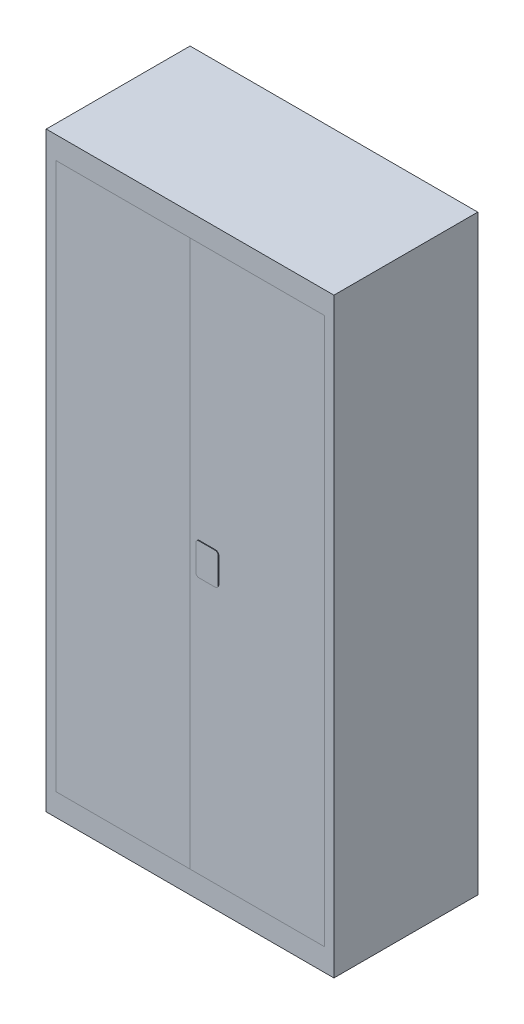
ISO-10303-21;
HEADER;
FILE_DESCRIPTION(('STEP AP214'),'2;1');
FILE_NAME('part.step','',(''),(''),'','','');
FILE_SCHEMA(('AUTOMOTIVE_DESIGN { 1 0 10303 214 1 1 1 1 }'));
ENDSEC;
DATA;
#1=APPLICATION_CONTEXT('core data for automotive mechanical design processes');
#2=APPLICATION_PROTOCOL_DEFINITION('international standard','automotive_design',2000,#1);
#3=PRODUCT_CONTEXT('',#1,'mechanical');
#4=PRODUCT('Part','Part','',(#3));
#5=PRODUCT_RELATED_PRODUCT_CATEGORY('part','',(#4));
#6=PRODUCT_DEFINITION_FORMATION('','',#4);
#7=PRODUCT_DEFINITION_CONTEXT('part definition',#1,'design');
#8=PRODUCT_DEFINITION('design','',#6,#7);
#9=PRODUCT_DEFINITION_SHAPE('','',#8);
#10=(LENGTH_UNIT() NAMED_UNIT(*) SI_UNIT(.MILLI.,.METRE.));
#11=(NAMED_UNIT(*) PLANE_ANGLE_UNIT() SI_UNIT($,.RADIAN.));
#12=(NAMED_UNIT(*) SI_UNIT($,.STERADIAN.) SOLID_ANGLE_UNIT());
#13=UNCERTAINTY_MEASURE_WITH_UNIT(LENGTH_MEASURE(1.E-05),#10,'distance_accuracy_value','');
#14=(GEOMETRIC_REPRESENTATION_CONTEXT(3) GLOBAL_UNCERTAINTY_ASSIGNED_CONTEXT((#13)) GLOBAL_UNIT_ASSIGNED_CONTEXT((#10,
#11,#12)) REPRESENTATION_CONTEXT('',''));
#15=CARTESIAN_POINT('',(0.,0.,0.));
#16=DIRECTION('',(0.,0.,1.));
#17=DIRECTION('',(1.,0.,0.));
#18=AXIS2_PLACEMENT_3D('',#15,#16,#17);
#19=CARTESIAN_POINT('',(0.,0.,0.));
#20=DIRECTION('',(0.,0.,1.));
#21=DIRECTION('',(1.,0.,0.));
#22=AXIS2_PLACEMENT_3D('',#19,#20,#21);
#23=PLANE('',#22);
#24=DIRECTION('',(1.,0.,0.));
#25=VECTOR('',#24,1.);
#26=CARTESIAN_POINT('',(0.,1780.,0.));
#27=LINE('',#26,#25);
#28=CARTESIAN_POINT('',(450.,1780.,0.));
#29=VERTEX_POINT('',#28);
#30=CARTESIAN_POINT('',(870.,1780.,0.));
#31=VERTEX_POINT('',#30);
#32=EDGE_CURVE('E178',#29,#31,#27,.T.);
#33=ORIENTED_EDGE('',*,*,#32,.F.);
#34=DIRECTION('',(0.,-1.,0.));
#35=VECTOR('',#34,1.);
#36=CARTESIAN_POINT('',(450.,0.,0.));
#37=LINE('',#36,#35);
#38=CARTESIAN_POINT('',(450.,70.,0.));
#39=VERTEX_POINT('',#38);
#40=EDGE_CURVE('E180',#29,#39,#37,.T.);
#41=ORIENTED_EDGE('',*,*,#40,.T.);
#42=DIRECTION('',(1.,0.,0.));
#43=VECTOR('',#42,1.);
#44=CARTESIAN_POINT('',(0.,70.,0.));
#45=LINE('',#44,#43);
#46=CARTESIAN_POINT('',(870.,70.,0.));
#47=VERTEX_POINT('',#46);
#48=EDGE_CURVE('E183',#39,#47,#45,.T.);
#49=ORIENTED_EDGE('',*,*,#48,.T.);
#50=DIRECTION('',(0.,-1.,0.));
#51=VECTOR('',#50,1.);
#52=CARTESIAN_POINT('',(870.,1.12970062154841E-13,0.));
#53=LINE('',#52,#51);
#54=EDGE_CURVE('E185',#31,#47,#53,.T.);
#55=ORIENTED_EDGE('',*,*,#54,.F.);
#56=EDGE_LOOP('',(#33,#41,#49,#55));
#57=FACE_BOUND('',#56,.T.);
#58=DIRECTION('',(1.,0.,0.));
#59=VECTOR('',#58,1.);
#60=CARTESIAN_POINT('',(480.,875.,0.));
#61=LINE('',#60,#59);
#62=CARTESIAN_POINT('',(480.,875.,0.));
#63=VERTEX_POINT('',#62);
#64=CARTESIAN_POINT('',(530.,875.,0.));
#65=VERTEX_POINT('',#64);
#66=EDGE_CURVE('E348',#63,#65,#61,.T.);
#67=ORIENTED_EDGE('',*,*,#66,.F.);
#68=CARTESIAN_POINT('',(480.,885.,0.));
#69=DIRECTION('',(0.,0.,1.));
#70=DIRECTION('',(1.,0.,0.));
#71=AXIS2_PLACEMENT_3D('',#68,#69,#70);
#72=CIRCLE('',#71,10.);
#73=CARTESIAN_POINT('',(470.,885.,0.));
#74=VERTEX_POINT('',#73);
#75=EDGE_CURVE('E168',#74,#63,#72,.T.);
#76=ORIENTED_EDGE('',*,*,#75,.F.);
#77=DIRECTION('',(0.,-1.,0.));
#78=VECTOR('',#77,1.);
#79=CARTESIAN_POINT('',(470.,965.,0.));
#80=LINE('',#79,#78);
#81=CARTESIAN_POINT('',(470.,965.,0.));
#82=VERTEX_POINT('',#81);
#83=EDGE_CURVE('E164',#82,#74,#80,.T.);
#84=ORIENTED_EDGE('',*,*,#83,.F.);
#85=CARTESIAN_POINT('',(480.,965.,0.));
#86=DIRECTION('',(0.,0.,1.));
#87=DIRECTION('',(1.,0.,0.));
#88=AXIS2_PLACEMENT_3D('',#85,#86,#87);
#89=CIRCLE('',#88,10.);
#90=CARTESIAN_POINT('',(480.,975.,0.));
#91=VERTEX_POINT('',#90);
#92=EDGE_CURVE('E344',#91,#82,#89,.T.);
#93=ORIENTED_EDGE('',*,*,#92,.F.);
#94=DIRECTION('',(-1.,0.,0.));
#95=VECTOR('',#94,1.);
#96=CARTESIAN_POINT('',(480.,975.,0.));
#97=LINE('',#96,#95);
#98=CARTESIAN_POINT('',(530.,975.,0.));
#99=VERTEX_POINT('',#98);
#100=EDGE_CURVE('E360',#99,#91,#97,.T.);
#101=ORIENTED_EDGE('',*,*,#100,.F.);
#102=CARTESIAN_POINT('',(530.,965.,0.));
#103=DIRECTION('',(0.,0.,1.));
#104=DIRECTION('',(-1.,0.,0.));
#105=AXIS2_PLACEMENT_3D('',#102,#103,#104);
#106=CIRCLE('',#105,10.);
#107=CARTESIAN_POINT('',(540.,965.,0.));
#108=VERTEX_POINT('',#107);
#109=EDGE_CURVE('E358',#108,#99,#106,.T.);
#110=ORIENTED_EDGE('',*,*,#109,.F.);
#111=DIRECTION('',(0.,1.,0.));
#112=VECTOR('',#111,1.);
#113=CARTESIAN_POINT('',(540.,965.,0.));
#114=LINE('',#113,#112);
#115=CARTESIAN_POINT('',(540.,885.,0.));
#116=VERTEX_POINT('',#115);
#117=EDGE_CURVE('E356',#116,#108,#114,.T.);
#118=ORIENTED_EDGE('',*,*,#117,.F.);
#119=CARTESIAN_POINT('',(530.,885.,0.));
#120=DIRECTION('',(0.,0.,1.));
#121=DIRECTION('',(1.,0.,0.));
#122=AXIS2_PLACEMENT_3D('',#119,#120,#121);
#123=CIRCLE('',#122,10.);
#124=EDGE_CURVE('E350',#65,#116,#123,.T.);
#125=ORIENTED_EDGE('',*,*,#124,.F.);
#126=EDGE_LOOP('',(#67,#76,#84,#93,#101,#110,#118,#125));
#127=FACE_BOUND('',#126,.T.);
#128=ADVANCED_FACE('F52',(#57,#127),#23,.T.);
#129=CARTESIAN_POINT('',(0.,1780.,0.));
#130=DIRECTION('',(0.,1.,0.));
#131=DIRECTION('',(0.,0.,1.));
#132=AXIS2_PLACEMENT_3D('',#129,#130,#131);
#133=PLANE('',#132);
#134=DIRECTION('',(1.,0.,0.));
#135=VECTOR('',#134,1.);
#136=CARTESIAN_POINT('',(0.,1780.,-20.));
#137=LINE('',#136,#135);
#138=CARTESIAN_POINT('',(450.,1780.,-20.));
#139=VERTEX_POINT('',#138);
#140=CARTESIAN_POINT('',(870.,1780.,-20.));
#141=VERTEX_POINT('',#140);
#142=EDGE_CURVE('E170',#139,#141,#137,.T.);
#143=ORIENTED_EDGE('',*,*,#142,.F.);
#144=DIRECTION('',(0.,0.,-1.));
#145=VECTOR('',#144,1.);
#146=CARTESIAN_POINT('',(450.,1780.,0.));
#147=LINE('',#146,#145);
#148=EDGE_CURVE('E12',#29,#139,#147,.T.);
#149=ORIENTED_EDGE('',*,*,#148,.F.);
#150=ORIENTED_EDGE('',*,*,#32,.T.);
#151=DIRECTION('',(0.,0.,-1.));
#152=VECTOR('',#151,1.);
#153=CARTESIAN_POINT('',(870.,1780.,0.));
#154=LINE('',#153,#152);
#155=EDGE_CURVE('E76',#31,#141,#154,.T.);
#156=ORIENTED_EDGE('',*,*,#155,.T.);
#157=EDGE_LOOP('',(#143,#149,#150,#156));
#158=FACE_BOUND('',#157,.T.);
#159=ADVANCED_FACE('F54',(#158),#133,.T.);
#160=CARTESIAN_POINT('',(450.,0.,0.));
#161=DIRECTION('',(1.,0.,0.));
#162=DIRECTION('',(0.,1.,0.));
#163=AXIS2_PLACEMENT_3D('',#160,#161,#162);
#164=PLANE('',#163);
#165=DIRECTION('',(0.,-1.,0.));
#166=VECTOR('',#165,1.);
#167=CARTESIAN_POINT('',(450.,0.,-20.));
#168=LINE('',#167,#166);
#169=CARTESIAN_POINT('',(450.,70.,-20.));
#170=VERTEX_POINT('',#169);
#171=EDGE_CURVE('E172',#139,#170,#168,.T.);
#172=ORIENTED_EDGE('',*,*,#171,.T.);
#173=DIRECTION('',(0.,0.,-1.));
#174=VECTOR('',#173,1.);
#175=CARTESIAN_POINT('',(450.,70.,0.));
#176=LINE('',#175,#174);
#177=EDGE_CURVE('E60',#39,#170,#176,.T.);
#178=ORIENTED_EDGE('',*,*,#177,.F.);
#179=ORIENTED_EDGE('',*,*,#40,.F.);
#180=ORIENTED_EDGE('',*,*,#148,.T.);
#181=EDGE_LOOP('',(#172,#178,#179,#180));
#182=FACE_BOUND('',#181,.T.);
#183=ADVANCED_FACE('F211',(#182),#164,.F.);
#184=CARTESIAN_POINT('',(0.,70.,0.));
#185=DIRECTION('',(0.,1.,0.));
#186=DIRECTION('',(0.,0.,1.));
#187=AXIS2_PLACEMENT_3D('',#184,#185,#186);
#188=PLANE('',#187);
#189=DIRECTION('',(1.,0.,0.));
#190=VECTOR('',#189,1.);
#191=CARTESIAN_POINT('',(0.,70.,-20.));
#192=LINE('',#191,#190);
#193=CARTESIAN_POINT('',(870.,70.,-20.));
#194=VERTEX_POINT('',#193);
#195=EDGE_CURVE('E188',#170,#194,#192,.T.);
#196=ORIENTED_EDGE('',*,*,#195,.T.);
#197=DIRECTION('',(0.,0.,-1.));
#198=VECTOR('',#197,1.);
#199=CARTESIAN_POINT('',(870.,70.,0.));
#200=LINE('',#199,#198);
#201=EDGE_CURVE('E194',#47,#194,#200,.T.);
#202=ORIENTED_EDGE('',*,*,#201,.F.);
#203=ORIENTED_EDGE('',*,*,#48,.F.);
#204=ORIENTED_EDGE('',*,*,#177,.T.);
#205=EDGE_LOOP('',(#196,#202,#203,#204));
#206=FACE_BOUND('',#205,.T.);
#207=ADVANCED_FACE('F200',(#206),#188,.F.);
#208=CARTESIAN_POINT('',(870.,1.12970062154841E-13,0.));
#209=DIRECTION('',(1.,0.,0.));
#210=DIRECTION('',(0.,1.,0.));
#211=AXIS2_PLACEMENT_3D('',#208,#209,#210);
#212=PLANE('',#211);
#213=DIRECTION('',(0.,-1.,0.));
#214=VECTOR('',#213,1.);
#215=CARTESIAN_POINT('',(870.,1.12970062154841E-13,-20.));
#216=LINE('',#215,#214);
#217=EDGE_CURVE('E181',#141,#194,#216,.T.);
#218=ORIENTED_EDGE('',*,*,#217,.F.);
#219=ORIENTED_EDGE('',*,*,#155,.F.);
#220=ORIENTED_EDGE('',*,*,#54,.T.);
#221=ORIENTED_EDGE('',*,*,#201,.T.);
#222=EDGE_LOOP('',(#218,#219,#220,#221));
#223=FACE_BOUND('',#222,.T.);
#224=ADVANCED_FACE('F206',(#223),#212,.T.);
#225=CARTESIAN_POINT('',(0.,0.,-20.));
#226=DIRECTION('',(0.,0.,1.));
#227=DIRECTION('',(1.,0.,0.));
#228=AXIS2_PLACEMENT_3D('',#225,#226,#227);
#229=PLANE('',#228);
#230=ORIENTED_EDGE('',*,*,#142,.T.);
#231=ORIENTED_EDGE('',*,*,#217,.T.);
#232=ORIENTED_EDGE('',*,*,#195,.F.);
#233=ORIENTED_EDGE('',*,*,#171,.F.);
#234=EDGE_LOOP('',(#230,#231,#232,#233));
#235=FACE_BOUND('',#234,.T.);
#236=ADVANCED_FACE('F205',(#235),#229,.F.);
#237=CARTESIAN_POINT('',(480.,885.,2.));
#238=DIRECTION('',(0.,0.,-1.));
#239=DIRECTION('',(-1.,0.,0.));
#240=AXIS2_PLACEMENT_3D('',#237,#238,#239);
#241=CYLINDRICAL_SURFACE('',#240,10.);
#242=ORIENTED_EDGE('',*,*,#75,.T.);
#243=DIRECTION('',(0.,0.,-1.));
#244=VECTOR('',#243,1.);
#245=CARTESIAN_POINT('',(480.,875.,2.));
#246=LINE('',#245,#244);
#247=CARTESIAN_POINT('',(480.,875.,2.));
#248=VERTEX_POINT('',#247);
#249=EDGE_CURVE('E149',#248,#63,#246,.T.);
#250=ORIENTED_EDGE('',*,*,#249,.F.);
#251=CARTESIAN_POINT('',(480.,885.,2.));
#252=DIRECTION('',(0.,0.,1.));
#253=DIRECTION('',(1.,0.,0.));
#254=AXIS2_PLACEMENT_3D('',#251,#252,#253);
#255=CIRCLE('',#254,10.);
#256=CARTESIAN_POINT('',(470.,885.,2.));
#257=VERTEX_POINT('',#256);
#258=EDGE_CURVE('E156',#257,#248,#255,.T.);
#259=ORIENTED_EDGE('',*,*,#258,.F.);
#260=DIRECTION('',(0.,0.,-1.));
#261=VECTOR('',#260,1.);
#262=CARTESIAN_POINT('',(470.,885.,2.));
#263=LINE('',#262,#261);
#264=EDGE_CURVE('E342',#257,#74,#263,.T.);
#265=ORIENTED_EDGE('',*,*,#264,.T.);
#266=EDGE_LOOP('',(#242,#250,#259,#265));
#267=FACE_BOUND('',#266,.T.);
#268=ADVANCED_FACE('F166',(#267),#241,.T.);
#269=CARTESIAN_POINT('',(480.,875.,2.));
#270=DIRECTION('',(0.,1.,0.));
#271=DIRECTION('',(-1.,0.,0.));
#272=AXIS2_PLACEMENT_3D('',#269,#270,#271);
#273=PLANE('',#272);
#274=ORIENTED_EDGE('',*,*,#66,.T.);
#275=DIRECTION('',(0.,0.,-1.));
#276=VECTOR('',#275,1.);
#277=CARTESIAN_POINT('',(530.,875.,2.));
#278=LINE('',#277,#276);
#279=CARTESIAN_POINT('',(530.,875.,2.));
#280=VERTEX_POINT('',#279);
#281=EDGE_CURVE('E152',#280,#65,#278,.T.);
#282=ORIENTED_EDGE('',*,*,#281,.F.);
#283=DIRECTION('',(1.,0.,0.));
#284=VECTOR('',#283,1.);
#285=CARTESIAN_POINT('',(480.,875.,2.));
#286=LINE('',#285,#284);
#287=EDGE_CURVE('E145',#248,#280,#286,.T.);
#288=ORIENTED_EDGE('',*,*,#287,.F.);
#289=ORIENTED_EDGE('',*,*,#249,.T.);
#290=EDGE_LOOP('',(#274,#282,#288,#289));
#291=FACE_BOUND('',#290,.T.);
#292=ADVANCED_FACE('F147',(#291),#273,.F.);
#293=CARTESIAN_POINT('',(530.,885.,2.));
#294=DIRECTION('',(0.,0.,-1.));
#295=DIRECTION('',(-1.,0.,0.));
#296=AXIS2_PLACEMENT_3D('',#293,#294,#295);
#297=CYLINDRICAL_SURFACE('',#296,10.);
#298=ORIENTED_EDGE('',*,*,#124,.T.);
#299=DIRECTION('',(0.,0.,-1.));
#300=VECTOR('',#299,1.);
#301=CARTESIAN_POINT('',(540.,885.,2.));
#302=LINE('',#301,#300);
#303=CARTESIAN_POINT('',(540.,885.,2.));
#304=VERTEX_POINT('',#303);
#305=EDGE_CURVE('E174',#304,#116,#302,.T.);
#306=ORIENTED_EDGE('',*,*,#305,.F.);
#307=CARTESIAN_POINT('',(530.,885.,2.));
#308=DIRECTION('',(0.,0.,1.));
#309=DIRECTION('',(1.,0.,0.));
#310=AXIS2_PLACEMENT_3D('',#307,#308,#309);
#311=CIRCLE('',#310,10.);
#312=EDGE_CURVE('E155',#280,#304,#311,.T.);
#313=ORIENTED_EDGE('',*,*,#312,.F.);
#314=ORIENTED_EDGE('',*,*,#281,.T.);
#315=EDGE_LOOP('',(#298,#306,#313,#314));
#316=FACE_BOUND('',#315,.T.);
#317=ADVANCED_FACE('F247',(#316),#297,.T.);
#318=CARTESIAN_POINT('',(540.,965.,2.));
#319=DIRECTION('',(-1.,0.,0.));
#320=DIRECTION('',(0.,0.,1.));
#321=AXIS2_PLACEMENT_3D('',#318,#319,#320);
#322=PLANE('',#321);
#323=ORIENTED_EDGE('',*,*,#117,.T.);
#324=DIRECTION('',(0.,0.,-1.));
#325=VECTOR('',#324,1.);
#326=CARTESIAN_POINT('',(540.,965.,2.));
#327=LINE('',#326,#325);
#328=CARTESIAN_POINT('',(540.,965.,2.));
#329=VERTEX_POINT('',#328);
#330=EDGE_CURVE('E370',#329,#108,#327,.T.);
#331=ORIENTED_EDGE('',*,*,#330,.F.);
#332=DIRECTION('',(0.,1.,0.));
#333=VECTOR('',#332,1.);
#334=CARTESIAN_POINT('',(540.,965.,2.));
#335=LINE('',#334,#333);
#336=EDGE_CURVE('E377',#304,#329,#335,.T.);
#337=ORIENTED_EDGE('',*,*,#336,.F.);
#338=ORIENTED_EDGE('',*,*,#305,.T.);
#339=EDGE_LOOP('',(#323,#331,#337,#338));
#340=FACE_BOUND('',#339,.T.);
#341=ADVANCED_FACE('F253',(#340),#322,.F.);
#342=CARTESIAN_POINT('',(530.,965.,2.));
#343=DIRECTION('',(0.,0.,-1.));
#344=DIRECTION('',(-1.,0.,0.));
#345=AXIS2_PLACEMENT_3D('',#342,#343,#344);
#346=CYLINDRICAL_SURFACE('',#345,10.);
#347=ORIENTED_EDGE('',*,*,#109,.T.);
#348=DIRECTION('',(0.,0.,-1.));
#349=VECTOR('',#348,1.);
#350=CARTESIAN_POINT('',(530.,975.,2.));
#351=LINE('',#350,#349);
#352=CARTESIAN_POINT('',(530.,975.,2.));
#353=VERTEX_POINT('',#352);
#354=EDGE_CURVE('E367',#353,#99,#351,.T.);
#355=ORIENTED_EDGE('',*,*,#354,.F.);
#356=CARTESIAN_POINT('',(530.,965.,2.));
#357=DIRECTION('',(0.,0.,1.));
#358=DIRECTION('',(-1.,0.,0.));
#359=AXIS2_PLACEMENT_3D('',#356,#357,#358);
#360=CIRCLE('',#359,10.);
#361=EDGE_CURVE('E387',#329,#353,#360,.T.);
#362=ORIENTED_EDGE('',*,*,#361,.F.);
#363=ORIENTED_EDGE('',*,*,#330,.T.);
#364=EDGE_LOOP('',(#347,#355,#362,#363));
#365=FACE_BOUND('',#364,.T.);
#366=ADVANCED_FACE('F261',(#365),#346,.T.);
#367=CARTESIAN_POINT('',(480.,975.,2.));
#368=DIRECTION('',(0.,-1.,0.));
#369=DIRECTION('',(1.,0.,0.));
#370=AXIS2_PLACEMENT_3D('',#367,#368,#369);
#371=PLANE('',#370);
#372=ORIENTED_EDGE('',*,*,#100,.T.);
#373=DIRECTION('',(0.,0.,-1.));
#374=VECTOR('',#373,1.);
#375=CARTESIAN_POINT('',(480.,975.,2.));
#376=LINE('',#375,#374);
#377=CARTESIAN_POINT('',(480.,975.,2.));
#378=VERTEX_POINT('',#377);
#379=EDGE_CURVE('E364',#378,#91,#376,.T.);
#380=ORIENTED_EDGE('',*,*,#379,.F.);
#381=DIRECTION('',(-1.,0.,0.));
#382=VECTOR('',#381,1.);
#383=CARTESIAN_POINT('',(480.,975.,2.));
#384=LINE('',#383,#382);
#385=EDGE_CURVE('E384',#353,#378,#384,.T.);
#386=ORIENTED_EDGE('',*,*,#385,.F.);
#387=ORIENTED_EDGE('',*,*,#354,.T.);
#388=EDGE_LOOP('',(#372,#380,#386,#387));
#389=FACE_BOUND('',#388,.T.);
#390=ADVANCED_FACE('F269',(#389),#371,.F.);
#391=CARTESIAN_POINT('',(480.,965.,2.));
#392=DIRECTION('',(0.,0.,-1.));
#393=DIRECTION('',(-1.,0.,0.));
#394=AXIS2_PLACEMENT_3D('',#391,#392,#393);
#395=CYLINDRICAL_SURFACE('',#394,10.);
#396=ORIENTED_EDGE('',*,*,#92,.T.);
#397=DIRECTION('',(0.,0.,-1.));
#398=VECTOR('',#397,1.);
#399=CARTESIAN_POINT('',(470.,965.,2.));
#400=LINE('',#399,#398);
#401=CARTESIAN_POINT('',(470.,965.,2.));
#402=VERTEX_POINT('',#401);
#403=EDGE_CURVE('E67',#402,#82,#400,.T.);
#404=ORIENTED_EDGE('',*,*,#403,.F.);
#405=CARTESIAN_POINT('',(480.,965.,2.));
#406=DIRECTION('',(0.,0.,1.));
#407=DIRECTION('',(1.,0.,0.));
#408=AXIS2_PLACEMENT_3D('',#405,#406,#407);
#409=CIRCLE('',#408,10.);
#410=EDGE_CURVE('E386',#378,#402,#409,.T.);
#411=ORIENTED_EDGE('',*,*,#410,.F.);
#412=ORIENTED_EDGE('',*,*,#379,.T.);
#413=EDGE_LOOP('',(#396,#404,#411,#412));
#414=FACE_BOUND('',#413,.T.);
#415=ADVANCED_FACE('F277',(#414),#395,.T.);
#416=CARTESIAN_POINT('',(470.,965.,2.));
#417=DIRECTION('',(1.,0.,0.));
#418=DIRECTION('',(0.,1.,0.));
#419=AXIS2_PLACEMENT_3D('',#416,#417,#418);
#420=PLANE('',#419);
#421=ORIENTED_EDGE('',*,*,#83,.T.);
#422=ORIENTED_EDGE('',*,*,#264,.F.);
#423=DIRECTION('',(0.,-1.,0.));
#424=VECTOR('',#423,1.);
#425=CARTESIAN_POINT('',(470.,965.,2.));
#426=LINE('',#425,#424);
#427=EDGE_CURVE('E160',#402,#257,#426,.T.);
#428=ORIENTED_EDGE('',*,*,#427,.F.);
#429=ORIENTED_EDGE('',*,*,#403,.T.);
#430=EDGE_LOOP('',(#421,#422,#428,#429));
#431=FACE_BOUND('',#430,.T.);
#432=ADVANCED_FACE('F285',(#431),#420,.F.);
#433=CARTESIAN_POINT('',(480.,885.,2.));
#434=DIRECTION('',(0.,0.,1.));
#435=DIRECTION('',(1.,0.,0.));
#436=AXIS2_PLACEMENT_3D('',#433,#434,#435);
#437=PLANE('',#436);
#438=ORIENTED_EDGE('',*,*,#258,.T.);
#439=ORIENTED_EDGE('',*,*,#287,.T.);
#440=ORIENTED_EDGE('',*,*,#312,.T.);
#441=ORIENTED_EDGE('',*,*,#336,.T.);
#442=ORIENTED_EDGE('',*,*,#361,.T.);
#443=ORIENTED_EDGE('',*,*,#385,.T.);
#444=ORIENTED_EDGE('',*,*,#410,.T.);
#445=ORIENTED_EDGE('',*,*,#427,.T.);
#446=EDGE_LOOP('',(#438,#439,#440,#441,#442,#443,#444,#445));
#447=FACE_BOUND('',#446,.T.);
#448=ADVANCED_FACE('F159',(#447),#437,.T.);
#449=CLOSED_SHELL('',(#128,#159,#183,#207,#224,#236,#268,#292,#317,#341,#366,#390,#415,#432,#448));
#450=MANIFOLD_SOLID_BREP('B2',#449);
#451=CARTESIAN_POINT('',(450.,0.,0.));
#452=DIRECTION('',(1.,0.,0.));
#453=DIRECTION('',(0.,1.,0.));
#454=AXIS2_PLACEMENT_3D('',#451,#452,#453);
#455=PLANE('',#454);
#456=DIRECTION('',(0.,-1.,0.));
#457=VECTOR('',#456,1.);
#458=CARTESIAN_POINT('',(450.,0.,-20.));
#459=LINE('',#458,#457);
#460=CARTESIAN_POINT('',(450.,1780.,-20.));
#461=VERTEX_POINT('',#460);
#462=CARTESIAN_POINT('',(450.,70.,-20.));
#463=VERTEX_POINT('',#462);
#464=EDGE_CURVE('E467',#461,#463,#459,.T.);
#465=ORIENTED_EDGE('',*,*,#464,.F.);
#466=DIRECTION('',(0.,0.,-1.));
#467=VECTOR('',#466,1.);
#468=CARTESIAN_POINT('',(450.,1780.,0.));
#469=LINE('',#468,#467);
#470=CARTESIAN_POINT('',(450.,1780.,0.));
#471=VERTEX_POINT('',#470);
#472=EDGE_CURVE('E50',#471,#461,#469,.T.);
#473=ORIENTED_EDGE('',*,*,#472,.F.);
#474=DIRECTION('',(0.,-1.,0.));
#475=VECTOR('',#474,1.);
#476=CARTESIAN_POINT('',(450.,0.,0.));
#477=LINE('',#476,#475);
#478=CARTESIAN_POINT('',(450.,70.,0.));
#479=VERTEX_POINT('',#478);
#480=EDGE_CURVE('E461',#471,#479,#477,.T.);
#481=ORIENTED_EDGE('',*,*,#480,.T.);
#482=DIRECTION('',(0.,0.,-1.));
#483=VECTOR('',#482,1.);
#484=CARTESIAN_POINT('',(450.,70.,0.));
#485=LINE('',#484,#483);
#486=EDGE_CURVE('E442',#479,#463,#485,.T.);
#487=ORIENTED_EDGE('',*,*,#486,.T.);
#488=EDGE_LOOP('',(#465,#473,#481,#487));
#489=FACE_BOUND('',#488,.T.);
#490=ADVANCED_FACE('F404',(#489),#455,.T.);
#491=CARTESIAN_POINT('',(0.,1780.,0.));
#492=DIRECTION('',(0.,1.,0.));
#493=DIRECTION('',(0.,0.,1.));
#494=AXIS2_PLACEMENT_3D('',#491,#492,#493);
#495=PLANE('',#494);
#496=DIRECTION('',(1.,0.,0.));
#497=VECTOR('',#496,1.);
#498=CARTESIAN_POINT('',(0.,1780.,-20.));
#499=LINE('',#498,#497);
#500=CARTESIAN_POINT('',(30.,1780.,-20.));
#501=VERTEX_POINT('',#500);
#502=EDGE_CURVE('E455',#501,#461,#499,.T.);
#503=ORIENTED_EDGE('',*,*,#502,.F.);
#504=DIRECTION('',(0.,0.,-1.));
#505=VECTOR('',#504,1.);
#506=CARTESIAN_POINT('',(30.,1780.,0.));
#507=LINE('',#506,#505);
#508=CARTESIAN_POINT('',(30.,1780.,0.));
#509=VERTEX_POINT('',#508);
#510=EDGE_CURVE('E412',#509,#501,#507,.T.);
#511=ORIENTED_EDGE('',*,*,#510,.F.);
#512=DIRECTION('',(1.,0.,0.));
#513=VECTOR('',#512,1.);
#514=CARTESIAN_POINT('',(0.,1780.,0.));
#515=LINE('',#514,#513);
#516=EDGE_CURVE('E453',#509,#471,#515,.T.);
#517=ORIENTED_EDGE('',*,*,#516,.T.);
#518=ORIENTED_EDGE('',*,*,#472,.T.);
#519=EDGE_LOOP('',(#503,#511,#517,#518));
#520=FACE_BOUND('',#519,.T.);
#521=ADVANCED_FACE('F451',(#520),#495,.T.);
#522=CARTESIAN_POINT('',(30.0000000000002,0.,0.));
#523=DIRECTION('',(1.,0.,0.));
#524=DIRECTION('',(0.,1.,0.));
#525=AXIS2_PLACEMENT_3D('',#522,#523,#524);
#526=PLANE('',#525);
#527=DIRECTION('',(0.,-1.,0.));
#528=VECTOR('',#527,1.);
#529=CARTESIAN_POINT('',(30.0000000000002,0.,-20.));
#530=LINE('',#529,#528);
#531=CARTESIAN_POINT('',(30.0000000000002,70.,-20.));
#532=VERTEX_POINT('',#531);
#533=EDGE_CURVE('E435',#501,#532,#530,.T.);
#534=ORIENTED_EDGE('',*,*,#533,.T.);
#535=DIRECTION('',(0.,0.,-1.));
#536=VECTOR('',#535,1.);
#537=CARTESIAN_POINT('',(30.0000000000002,70.,0.));
#538=LINE('',#537,#536);
#539=CARTESIAN_POINT('',(30.0000000000002,70.,0.));
#540=VERTEX_POINT('',#539);
#541=EDGE_CURVE('E456',#540,#532,#538,.T.);
#542=ORIENTED_EDGE('',*,*,#541,.F.);
#543=DIRECTION('',(0.,-1.,0.));
#544=VECTOR('',#543,1.);
#545=CARTESIAN_POINT('',(30.0000000000002,0.,0.));
#546=LINE('',#545,#544);
#547=EDGE_CURVE('E457',#509,#540,#546,.T.);
#548=ORIENTED_EDGE('',*,*,#547,.F.);
#549=ORIENTED_EDGE('',*,*,#510,.T.);
#550=EDGE_LOOP('',(#534,#542,#548,#549));
#551=FACE_BOUND('',#550,.T.);
#552=ADVANCED_FACE('F458',(#551),#526,.F.);
#553=CARTESIAN_POINT('',(0.,70.,0.));
#554=DIRECTION('',(0.,1.,0.));
#555=DIRECTION('',(0.,0.,1.));
#556=AXIS2_PLACEMENT_3D('',#553,#554,#555);
#557=PLANE('',#556);
#558=DIRECTION('',(1.,0.,0.));
#559=VECTOR('',#558,1.);
#560=CARTESIAN_POINT('',(0.,70.,-20.));
#561=LINE('',#560,#559);
#562=EDGE_CURVE('E463',#532,#463,#561,.T.);
#563=ORIENTED_EDGE('',*,*,#562,.T.);
#564=ORIENTED_EDGE('',*,*,#486,.F.);
#565=DIRECTION('',(1.,0.,0.));
#566=VECTOR('',#565,1.);
#567=CARTESIAN_POINT('',(0.,70.,0.));
#568=LINE('',#567,#566);
#569=EDGE_CURVE('E420',#540,#479,#568,.T.);
#570=ORIENTED_EDGE('',*,*,#569,.F.);
#571=ORIENTED_EDGE('',*,*,#541,.T.);
#572=EDGE_LOOP('',(#563,#564,#570,#571));
#573=FACE_BOUND('',#572,.T.);
#574=ADVANCED_FACE('F476',(#573),#557,.F.);
#575=CARTESIAN_POINT('',(0.,0.,0.));
#576=DIRECTION('',(0.,0.,1.));
#577=DIRECTION('',(1.,0.,0.));
#578=AXIS2_PLACEMENT_3D('',#575,#576,#577);
#579=PLANE('',#578);
#580=ORIENTED_EDGE('',*,*,#480,.F.);
#581=ORIENTED_EDGE('',*,*,#516,.F.);
#582=ORIENTED_EDGE('',*,*,#547,.T.);
#583=ORIENTED_EDGE('',*,*,#569,.T.);
#584=EDGE_LOOP('',(#580,#581,#582,#583));
#585=FACE_BOUND('',#584,.T.);
#586=ADVANCED_FACE('F460',(#585),#579,.T.);
#587=CARTESIAN_POINT('',(0.,0.,-20.));
#588=DIRECTION('',(0.,0.,1.));
#589=DIRECTION('',(1.,0.,0.));
#590=AXIS2_PLACEMENT_3D('',#587,#588,#589);
#591=PLANE('',#590);
#592=ORIENTED_EDGE('',*,*,#464,.T.);
#593=ORIENTED_EDGE('',*,*,#562,.F.);
#594=ORIENTED_EDGE('',*,*,#533,.F.);
#595=ORIENTED_EDGE('',*,*,#502,.T.);
#596=EDGE_LOOP('',(#592,#593,#594,#595));
#597=FACE_BOUND('',#596,.T.);
#598=ADVANCED_FACE('F478',(#597),#591,.F.);
#599=CLOSED_SHELL('',(#490,#521,#552,#574,#586,#598));
#600=MANIFOLD_SOLID_BREP('B6',#599);
#601=CARTESIAN_POINT('',(0.,0.,-450.));
#602=DIRECTION('',(-1.,0.,0.));
#603=DIRECTION('',(0.,0.,1.));
#604=AXIS2_PLACEMENT_3D('',#601,#602,#603);
#605=PLANE('',#604);
#606=DIRECTION('',(0.,-1.,0.));
#607=VECTOR('',#606,1.);
#608=CARTESIAN_POINT('',(0.,0.,0.));
#609=LINE('',#608,#607);
#610=CARTESIAN_POINT('',(0.,1850.,0.));
#611=VERTEX_POINT('',#610);
#612=CARTESIAN_POINT('',(0.,0.,0.));
#613=VERTEX_POINT('',#612);
#614=EDGE_CURVE('E646',#611,#613,#609,.T.);
#615=ORIENTED_EDGE('',*,*,#614,.F.);
#616=DIRECTION('',(0.,0.,1.));
#617=VECTOR('',#616,1.);
#618=CARTESIAN_POINT('',(0.,1850.,-450.));
#619=LINE('',#618,#617);
#620=CARTESIAN_POINT('',(0.,1850.,-450.));
#621=VERTEX_POINT('',#620);
#622=EDGE_CURVE('E402',#621,#611,#619,.T.);
#623=ORIENTED_EDGE('',*,*,#622,.F.);
#624=DIRECTION('',(0.,-1.,0.));
#625=VECTOR('',#624,1.);
#626=CARTESIAN_POINT('',(0.,0.,-450.));
#627=LINE('',#626,#625);
#628=CARTESIAN_POINT('',(0.,0.,-450.));
#629=VERTEX_POINT('',#628);
#630=EDGE_CURVE('E652',#621,#629,#627,.T.);
#631=ORIENTED_EDGE('',*,*,#630,.T.);
#632=DIRECTION('',(0.,0.,1.));
#633=VECTOR('',#632,1.);
#634=CARTESIAN_POINT('',(0.,0.,-450.));
#635=LINE('',#634,#633);
#636=EDGE_CURVE('E531',#629,#613,#635,.T.);
#637=ORIENTED_EDGE('',*,*,#636,.T.);
#638=EDGE_LOOP('',(#615,#623,#631,#637));
#639=FACE_BOUND('',#638,.T.);
#640=ADVANCED_FACE('F528',(#639),#605,.T.);
#641=CARTESIAN_POINT('',(0.,1850.,-450.));
#642=DIRECTION('',(0.,1.,0.));
#643=DIRECTION('',(0.,0.,1.));
#644=AXIS2_PLACEMENT_3D('',#641,#642,#643);
#645=PLANE('',#644);
#646=DIRECTION('',(-1.,0.,0.));
#647=VECTOR('',#646,1.);
#648=CARTESIAN_POINT('',(0.,1850.,0.));
#649=LINE('',#648,#647);
#650=CARTESIAN_POINT('',(900.,1850.,0.));
#651=VERTEX_POINT('',#650);
#652=EDGE_CURVE('E656',#651,#611,#649,.T.);
#653=ORIENTED_EDGE('',*,*,#652,.F.);
#654=DIRECTION('',(0.,0.,1.));
#655=VECTOR('',#654,1.);
#656=CARTESIAN_POINT('',(900.,1850.,-450.));
#657=LINE('',#656,#655);
#658=CARTESIAN_POINT('',(900.,1850.,-450.));
#659=VERTEX_POINT('',#658);
#660=EDGE_CURVE('E537',#659,#651,#657,.T.);
#661=ORIENTED_EDGE('',*,*,#660,.F.);
#662=DIRECTION('',(-1.,0.,0.));
#663=VECTOR('',#662,1.);
#664=CARTESIAN_POINT('',(0.,1850.,-450.));
#665=LINE('',#664,#663);
#666=EDGE_CURVE('E663',#659,#621,#665,.T.);
#667=ORIENTED_EDGE('',*,*,#666,.T.);
#668=ORIENTED_EDGE('',*,*,#622,.T.);
#669=EDGE_LOOP('',(#653,#661,#667,#668));
#670=FACE_BOUND('',#669,.T.);
#671=ADVANCED_FACE('F688',(#670),#645,.T.);
#672=CARTESIAN_POINT('',(900.,0.,-450.));
#673=DIRECTION('',(1.,0.,0.));
#674=DIRECTION('',(0.,0.,-1.));
#675=AXIS2_PLACEMENT_3D('',#672,#673,#674);
#676=PLANE('',#675);
#677=DIRECTION('',(0.,1.,0.));
#678=VECTOR('',#677,1.);
#679=CARTESIAN_POINT('',(900.,0.,0.));
#680=LINE('',#679,#678);
#681=CARTESIAN_POINT('',(900.,0.,0.));
#682=VERTEX_POINT('',#681);
#683=EDGE_CURVE('E673',#682,#651,#680,.T.);
#684=ORIENTED_EDGE('',*,*,#683,.F.);
#685=DIRECTION('',(0.,0.,1.));
#686=VECTOR('',#685,1.);
#687=CARTESIAN_POINT('',(900.,0.,-450.));
#688=LINE('',#687,#686);
#689=CARTESIAN_POINT('',(900.,0.,-450.));
#690=VERTEX_POINT('',#689);
#691=EDGE_CURVE('E681',#690,#682,#688,.T.);
#692=ORIENTED_EDGE('',*,*,#691,.F.);
#693=DIRECTION('',(0.,1.,0.));
#694=VECTOR('',#693,1.);
#695=CARTESIAN_POINT('',(900.,0.,-450.));
#696=LINE('',#695,#694);
#697=EDGE_CURVE('E659',#690,#659,#696,.T.);
#698=ORIENTED_EDGE('',*,*,#697,.T.);
#699=ORIENTED_EDGE('',*,*,#660,.T.);
#700=EDGE_LOOP('',(#684,#692,#698,#699));
#701=FACE_BOUND('',#700,.T.);
#702=ADVANCED_FACE('F692',(#701),#676,.T.);
#703=CARTESIAN_POINT('',(0.,0.,-450.));
#704=DIRECTION('',(0.,-1.,0.));
#705=DIRECTION('',(0.,0.,-1.));
#706=AXIS2_PLACEMENT_3D('',#703,#704,#705);
#707=PLANE('',#706);
#708=DIRECTION('',(1.,0.,0.));
#709=VECTOR('',#708,1.);
#710=CARTESIAN_POINT('',(0.,0.,0.));
#711=LINE('',#710,#709);
#712=EDGE_CURVE('E669',#613,#682,#711,.T.);
#713=ORIENTED_EDGE('',*,*,#712,.F.);
#714=ORIENTED_EDGE('',*,*,#636,.F.);
#715=DIRECTION('',(1.,0.,0.));
#716=VECTOR('',#715,1.);
#717=CARTESIAN_POINT('',(0.,0.,-450.));
#718=LINE('',#717,#716);
#719=EDGE_CURVE('E655',#629,#690,#718,.T.);
#720=ORIENTED_EDGE('',*,*,#719,.T.);
#721=ORIENTED_EDGE('',*,*,#691,.T.);
#722=EDGE_LOOP('',(#713,#714,#720,#721));
#723=FACE_BOUND('',#722,.T.);
#724=ADVANCED_FACE('F685',(#723),#707,.T.);
#725=CARTESIAN_POINT('',(0.,0.,-450.));
#726=DIRECTION('',(0.,0.,-1.));
#727=DIRECTION('',(-1.,0.,0.));
#728=AXIS2_PLACEMENT_3D('',#725,#726,#727);
#729=PLANE('',#728);
#730=ORIENTED_EDGE('',*,*,#630,.F.);
#731=ORIENTED_EDGE('',*,*,#666,.F.);
#732=ORIENTED_EDGE('',*,*,#697,.F.);
#733=ORIENTED_EDGE('',*,*,#719,.F.);
#734=EDGE_LOOP('',(#730,#731,#732,#733));
#735=FACE_BOUND('',#734,.T.);
#736=ADVANCED_FACE('F694',(#735),#729,.T.);
#737=CARTESIAN_POINT('',(0.,0.,0.));
#738=DIRECTION('',(0.,0.,-1.));
#739=DIRECTION('',(-1.,0.,0.));
#740=AXIS2_PLACEMENT_3D('',#737,#738,#739);
#741=PLANE('',#740);
#742=DIRECTION('',(0.,-1.,0.));
#743=VECTOR('',#742,1.);
#744=CARTESIAN_POINT('',(870.,1.12970062154841E-13,0.));
#745=LINE('',#744,#743);
#746=CARTESIAN_POINT('',(870.,1780.,0.));
#747=VERTEX_POINT('',#746);
#748=CARTESIAN_POINT('',(870.,70.,0.));
#749=VERTEX_POINT('',#748);
#750=EDGE_CURVE('E637',#747,#749,#745,.T.);
#751=ORIENTED_EDGE('',*,*,#750,.T.);
#752=DIRECTION('',(1.,0.,0.));
#753=VECTOR('',#752,1.);
#754=CARTESIAN_POINT('',(0.,70.,0.));
#755=LINE('',#754,#753);
#756=CARTESIAN_POINT('',(30.0000000000002,70.,0.));
#757=VERTEX_POINT('',#756);
#758=EDGE_CURVE('E545',#757,#749,#755,.T.);
#759=ORIENTED_EDGE('',*,*,#758,.F.);
#760=DIRECTION('',(0.,-1.,0.));
#761=VECTOR('',#760,1.);
#762=CARTESIAN_POINT('',(30.0000000000002,0.,0.));
#763=LINE('',#762,#761);
#764=CARTESIAN_POINT('',(30.,1780.,0.));
#765=VERTEX_POINT('',#764);
#766=EDGE_CURVE('E624',#765,#757,#763,.T.);
#767=ORIENTED_EDGE('',*,*,#766,.F.);
#768=DIRECTION('',(1.,0.,0.));
#769=VECTOR('',#768,1.);
#770=CARTESIAN_POINT('',(0.,1780.,0.));
#771=LINE('',#770,#769);
#772=EDGE_CURVE('E628',#765,#747,#771,.T.);
#773=ORIENTED_EDGE('',*,*,#772,.T.);
#774=EDGE_LOOP('',(#751,#759,#767,#773));
#775=FACE_BOUND('',#774,.T.);
#776=ORIENTED_EDGE('',*,*,#614,.T.);
#777=ORIENTED_EDGE('',*,*,#712,.T.);
#778=ORIENTED_EDGE('',*,*,#683,.T.);
#779=ORIENTED_EDGE('',*,*,#652,.T.);
#780=EDGE_LOOP('',(#776,#777,#778,#779));
#781=FACE_BOUND('',#780,.T.);
#782=ADVANCED_FACE('F687',(#775,#781),#741,.F.);
#783=CARTESIAN_POINT('',(0.,70.,-20.));
#784=DIRECTION('',(0.,-1.,0.));
#785=DIRECTION('',(0.,0.,-1.));
#786=AXIS2_PLACEMENT_3D('',#783,#784,#785);
#787=PLANE('',#786);
#788=ORIENTED_EDGE('',*,*,#758,.T.);
#789=DIRECTION('',(0.,0.,1.));
#790=VECTOR('',#789,1.);
#791=CARTESIAN_POINT('',(870.,70.,-20.));
#792=LINE('',#791,#790);
#793=CARTESIAN_POINT('',(870.,70.,-20.));
#794=VERTEX_POINT('',#793);
#795=EDGE_CURVE('E605',#794,#749,#792,.T.);
#796=ORIENTED_EDGE('',*,*,#795,.F.);
#797=DIRECTION('',(1.,0.,0.));
#798=VECTOR('',#797,1.);
#799=CARTESIAN_POINT('',(0.,70.,-20.));
#800=LINE('',#799,#798);
#801=CARTESIAN_POINT('',(30.0000000000002,70.,-20.));
#802=VERTEX_POINT('',#801);
#803=EDGE_CURVE('E613',#802,#794,#800,.T.);
#804=ORIENTED_EDGE('',*,*,#803,.F.);
#805=DIRECTION('',(0.,0.,1.));
#806=VECTOR('',#805,1.);
#807=CARTESIAN_POINT('',(30.0000000000002,70.,-20.));
#808=LINE('',#807,#806);
#809=EDGE_CURVE('E643',#802,#757,#808,.T.);
#810=ORIENTED_EDGE('',*,*,#809,.T.);
#811=EDGE_LOOP('',(#788,#796,#804,#810));
#812=FACE_BOUND('',#811,.T.);
#813=ADVANCED_FACE('F616',(#812),#787,.F.);
#814=CARTESIAN_POINT('',(30.0000000000002,0.,-20.));
#815=DIRECTION('',(-1.,0.,0.));
#816=DIRECTION('',(0.,-1.,0.));
#817=AXIS2_PLACEMENT_3D('',#814,#815,#816);
#818=PLANE('',#817);
#819=ORIENTED_EDGE('',*,*,#766,.T.);
#820=ORIENTED_EDGE('',*,*,#809,.F.);
#821=DIRECTION('',(0.,-1.,0.));
#822=VECTOR('',#821,1.);
#823=CARTESIAN_POINT('',(30.0000000000002,0.,-20.));
#824=LINE('',#823,#822);
#825=CARTESIAN_POINT('',(30.,1780.,-20.));
#826=VERTEX_POINT('',#825);
#827=EDGE_CURVE('E619',#826,#802,#824,.T.);
#828=ORIENTED_EDGE('',*,*,#827,.F.);
#829=DIRECTION('',(0.,0.,1.));
#830=VECTOR('',#829,1.);
#831=CARTESIAN_POINT('',(30.,1780.,-20.));
#832=LINE('',#831,#830);
#833=EDGE_CURVE('E647',#826,#765,#832,.T.);
#834=ORIENTED_EDGE('',*,*,#833,.T.);
#835=EDGE_LOOP('',(#819,#820,#828,#834));
#836=FACE_BOUND('',#835,.T.);
#837=ADVANCED_FACE('F738',(#836),#818,.F.);
#838=CARTESIAN_POINT('',(0.,1780.,-20.));
#839=DIRECTION('',(0.,-1.,0.));
#840=DIRECTION('',(0.,0.,-1.));
#841=AXIS2_PLACEMENT_3D('',#838,#839,#840);
#842=PLANE('',#841);
#843=ORIENTED_EDGE('',*,*,#772,.F.);
#844=ORIENTED_EDGE('',*,*,#833,.F.);
#845=DIRECTION('',(1.,0.,0.));
#846=VECTOR('',#845,1.);
#847=CARTESIAN_POINT('',(0.,1780.,-20.));
#848=LINE('',#847,#846);
#849=CARTESIAN_POINT('',(870.,1780.,-20.));
#850=VERTEX_POINT('',#849);
#851=EDGE_CURVE('E612',#826,#850,#848,.T.);
#852=ORIENTED_EDGE('',*,*,#851,.T.);
#853=DIRECTION('',(0.,0.,1.));
#854=VECTOR('',#853,1.);
#855=CARTESIAN_POINT('',(870.,1780.,-20.));
#856=LINE('',#855,#854);
#857=EDGE_CURVE('E607',#850,#747,#856,.T.);
#858=ORIENTED_EDGE('',*,*,#857,.T.);
#859=EDGE_LOOP('',(#843,#844,#852,#858));
#860=FACE_BOUND('',#859,.T.);
#861=ADVANCED_FACE('F746',(#860),#842,.T.);
#862=CARTESIAN_POINT('',(870.,1.12970062154841E-13,-20.));
#863=DIRECTION('',(-1.,0.,0.));
#864=DIRECTION('',(0.,-1.,0.));
#865=AXIS2_PLACEMENT_3D('',#862,#863,#864);
#866=PLANE('',#865);
#867=ORIENTED_EDGE('',*,*,#750,.F.);
#868=ORIENTED_EDGE('',*,*,#857,.F.);
#869=DIRECTION('',(0.,-1.,0.));
#870=VECTOR('',#869,1.);
#871=CARTESIAN_POINT('',(870.,1.12970062154841E-13,-20.));
#872=LINE('',#871,#870);
#873=EDGE_CURVE('E602',#850,#794,#872,.T.);
#874=ORIENTED_EDGE('',*,*,#873,.T.);
#875=ORIENTED_EDGE('',*,*,#795,.T.);
#876=EDGE_LOOP('',(#867,#868,#874,#875));
#877=FACE_BOUND('',#876,.T.);
#878=ADVANCED_FACE('F604',(#877),#866,.T.);
#879=CARTESIAN_POINT('',(0.,0.,-20.));
#880=DIRECTION('',(0.,0.,1.));
#881=DIRECTION('',(1.,0.,0.));
#882=AXIS2_PLACEMENT_3D('',#879,#880,#881);
#883=PLANE('',#882);
#884=ORIENTED_EDGE('',*,*,#803,.T.);
#885=ORIENTED_EDGE('',*,*,#873,.F.);
#886=ORIENTED_EDGE('',*,*,#851,.F.);
#887=ORIENTED_EDGE('',*,*,#827,.T.);
#888=EDGE_LOOP('',(#884,#885,#886,#887));
#889=FACE_BOUND('',#888,.T.);
#890=ADVANCED_FACE('F621',(#889),#883,.T.);
#891=CLOSED_SHELL('',(#640,#671,#702,#724,#736,#782,#813,#837,#861,#878,#890));
#892=MANIFOLD_SOLID_BREP('B44',#891);
#893=ADVANCED_BREP_SHAPE_REPRESENTATION('',(#18,#450,#600,#892),#14);
#894=SHAPE_DEFINITION_REPRESENTATION(#9,#893);
ENDSEC;
END-ISO-10303-21;
